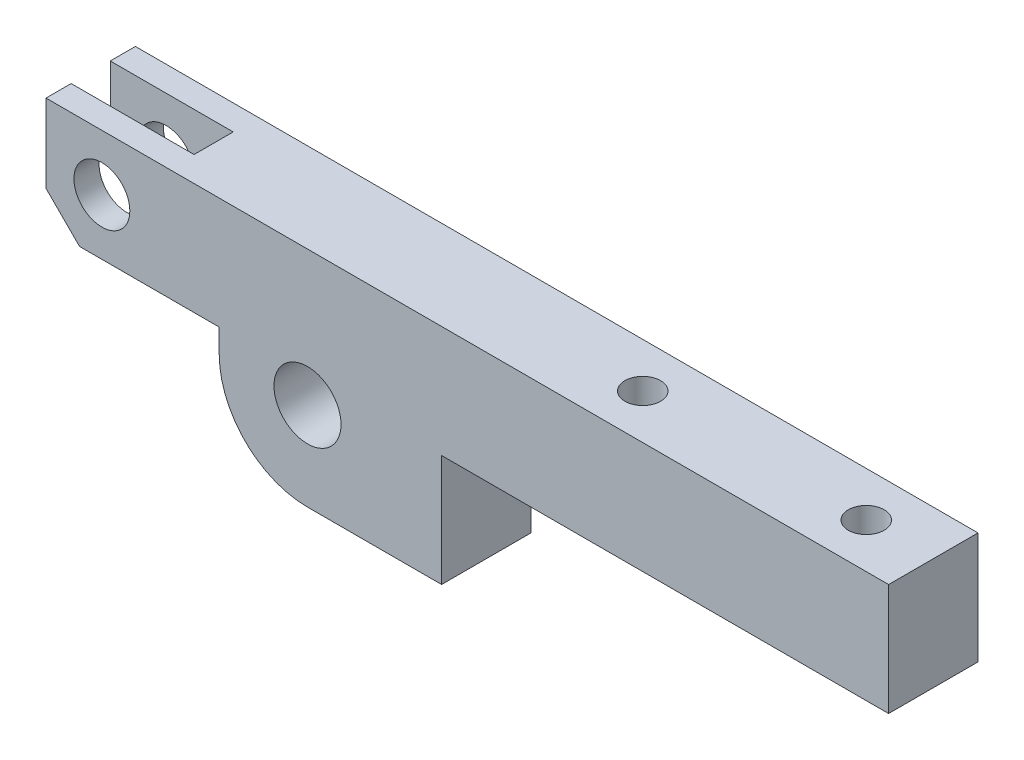
ISO-10303-21;
HEADER;
FILE_DESCRIPTION(('STEP AP214'),'2;1');
FILE_NAME('part.step','',(''),(''),'','','');
FILE_SCHEMA(('AUTOMOTIVE_DESIGN { 1 0 10303 214 1 1 1 1 }'));
ENDSEC;
DATA;
#1=APPLICATION_CONTEXT('core data for automotive mechanical design processes');
#2=APPLICATION_PROTOCOL_DEFINITION('international standard','automotive_design',2000,#1);
#3=PRODUCT_CONTEXT('',#1,'mechanical');
#4=PRODUCT('Part','Part','',(#3));
#5=PRODUCT_RELATED_PRODUCT_CATEGORY('part','',(#4));
#6=PRODUCT_DEFINITION_FORMATION('','',#4);
#7=PRODUCT_DEFINITION_CONTEXT('part definition',#1,'design');
#8=PRODUCT_DEFINITION('design','',#6,#7);
#9=PRODUCT_DEFINITION_SHAPE('','',#8);
#10=(LENGTH_UNIT() NAMED_UNIT(*) SI_UNIT(.MILLI.,.METRE.));
#11=(NAMED_UNIT(*) PLANE_ANGLE_UNIT() SI_UNIT($,.RADIAN.));
#12=(NAMED_UNIT(*) SI_UNIT($,.STERADIAN.) SOLID_ANGLE_UNIT());
#13=UNCERTAINTY_MEASURE_WITH_UNIT(LENGTH_MEASURE(1.E-05),#10,'distance_accuracy_value','');
#14=(GEOMETRIC_REPRESENTATION_CONTEXT(3) GLOBAL_UNCERTAINTY_ASSIGNED_CONTEXT((#13)) GLOBAL_UNIT_ASSIGNED_CONTEXT((#10,
#11,#12)) REPRESENTATION_CONTEXT('',''));
#15=CARTESIAN_POINT('',(0.,0.,0.));
#16=DIRECTION('',(0.,0.,1.));
#17=DIRECTION('',(1.,0.,0.));
#18=AXIS2_PLACEMENT_3D('',#15,#16,#17);
#19=CARTESIAN_POINT('',(-23.4,2.1,4.));
#20=DIRECTION('',(1.,0.,0.));
#21=DIRECTION('',(0.,0.,-1.));
#22=AXIS2_PLACEMENT_3D('',#19,#20,#21);
#23=PLANE('',#22);
#24=DIRECTION('',(0.,-1.,0.));
#25=VECTOR('',#24,1.);
#26=CARTESIAN_POINT('',(-23.4,12.1,-1.75));
#27=LINE('',#26,#25);
#28=CARTESIAN_POINT('',(-23.4,12.1,-1.75));
#29=VERTEX_POINT('',#28);
#30=CARTESIAN_POINT('',(-23.4,5.10000000000001,-1.75));
#31=VERTEX_POINT('',#30);
#32=EDGE_CURVE('E148',#29,#31,#27,.T.);
#33=ORIENTED_EDGE('',*,*,#32,.F.);
#34=DIRECTION('',(0.,0.,-1.));
#35=VECTOR('',#34,1.);
#36=CARTESIAN_POINT('',(-23.4,12.1,4.));
#37=LINE('',#36,#35);
#38=CARTESIAN_POINT('',(-23.4,12.1,-4.));
#39=VERTEX_POINT('',#38);
#40=EDGE_CURVE('E160',#29,#39,#37,.T.);
#41=ORIENTED_EDGE('',*,*,#40,.T.);
#42=DIRECTION('',(0.,-1.,0.));
#43=VECTOR('',#42,1.);
#44=CARTESIAN_POINT('',(-23.4,2.1,-4.));
#45=LINE('',#44,#43);
#46=CARTESIAN_POINT('',(-23.4,5.10000000000001,-4.));
#47=VERTEX_POINT('',#46);
#48=EDGE_CURVE('E252',#39,#47,#45,.T.);
#49=ORIENTED_EDGE('',*,*,#48,.T.);
#50=DIRECTION('',(0.,0.,1.));
#51=VECTOR('',#50,1.);
#52=CARTESIAN_POINT('',(-23.4,5.10000000000001,4.));
#53=LINE('',#52,#51);
#54=EDGE_CURVE('E43',#47,#31,#53,.T.);
#55=ORIENTED_EDGE('',*,*,#54,.T.);
#56=EDGE_LOOP('',(#33,#41,#49,#55));
#57=FACE_BOUND('',#56,.T.);
#58=ADVANCED_FACE('F34',(#57),#23,.F.);
#59=CARTESIAN_POINT('',(-7.9,2.1,4.));
#60=DIRECTION('',(0.,1.,0.));
#61=DIRECTION('',(-1.,0.,0.));
#62=AXIS2_PLACEMENT_3D('',#59,#60,#61);
#63=PLANE('',#62);
#64=DIRECTION('',(1.,0.,0.));
#65=VECTOR('',#64,1.);
#66=CARTESIAN_POINT('',(-20.4,2.1,-1.75));
#67=LINE('',#66,#65);
#68=CARTESIAN_POINT('',(-20.4,2.1,-1.75));
#69=VERTEX_POINT('',#68);
#70=CARTESIAN_POINT('',(-12.4,2.1,-1.75));
#71=VERTEX_POINT('',#70);
#72=EDGE_CURVE('E223',#69,#71,#67,.T.);
#73=ORIENTED_EDGE('',*,*,#72,.F.);
#74=DIRECTION('',(0.,0.,-1.));
#75=VECTOR('',#74,1.);
#76=CARTESIAN_POINT('',(-20.4,2.1,4.));
#77=LINE('',#76,#75);
#78=CARTESIAN_POINT('',(-20.4,2.1,-4.));
#79=VERTEX_POINT('',#78);
#80=EDGE_CURVE('E199',#69,#79,#77,.T.);
#81=ORIENTED_EDGE('',*,*,#80,.T.);
#82=DIRECTION('',(1.,0.,0.));
#83=VECTOR('',#82,1.);
#84=CARTESIAN_POINT('',(-7.9,2.1,-4.));
#85=LINE('',#84,#83);
#86=CARTESIAN_POINT('',(-7.9,2.1,-4.));
#87=VERTEX_POINT('',#86);
#88=EDGE_CURVE('E271',#79,#87,#85,.T.);
#89=ORIENTED_EDGE('',*,*,#88,.T.);
#90=DIRECTION('',(0.,0.,-1.));
#91=VECTOR('',#90,1.);
#92=CARTESIAN_POINT('',(-7.9,2.1,4.));
#93=LINE('',#92,#91);
#94=CARTESIAN_POINT('',(-7.9,2.1,4.));
#95=VERTEX_POINT('',#94);
#96=EDGE_CURVE('E196',#95,#87,#93,.T.);
#97=ORIENTED_EDGE('',*,*,#96,.F.);
#98=DIRECTION('',(1.,0.,0.));
#99=VECTOR('',#98,1.);
#100=CARTESIAN_POINT('',(-7.9,2.1,4.));
#101=LINE('',#100,#99);
#102=CARTESIAN_POINT('',(-20.4,2.1,4.));
#103=VERTEX_POINT('',#102);
#104=EDGE_CURVE('E257',#103,#95,#101,.T.);
#105=ORIENTED_EDGE('',*,*,#104,.F.);
#106=CARTESIAN_POINT('',(-20.4,2.1,1.75));
#107=VERTEX_POINT('',#106);
#108=EDGE_CURVE('E200',#103,#107,#77,.T.);
#109=ORIENTED_EDGE('',*,*,#108,.T.);
#110=DIRECTION('',(1.,0.,0.));
#111=VECTOR('',#110,1.);
#112=CARTESIAN_POINT('',(-20.4,2.1,1.75));
#113=LINE('',#112,#111);
#114=CARTESIAN_POINT('',(-12.4,2.1,1.75));
#115=VERTEX_POINT('',#114);
#116=EDGE_CURVE('E51',#107,#115,#113,.T.);
#117=ORIENTED_EDGE('',*,*,#116,.T.);
#118=DIRECTION('',(0.,0.,1.));
#119=VECTOR('',#118,1.);
#120=CARTESIAN_POINT('',(-12.4,2.1,-1.75));
#121=LINE('',#120,#119);
#122=EDGE_CURVE('E225',#71,#115,#121,.T.);
#123=ORIENTED_EDGE('',*,*,#122,.F.);
#124=EDGE_LOOP('',(#73,#81,#89,#97,#105,#109,#117,#123));
#125=FACE_BOUND('',#124,.T.);
#126=ADVANCED_FACE('F303',(#125),#63,.F.);
#127=CARTESIAN_POINT('',(-23.4,12.1,4.));
#128=DIRECTION('',(0.,-1.,0.));
#129=DIRECTION('',(0.,0.,-1.));
#130=AXIS2_PLACEMENT_3D('',#127,#128,#129);
#131=PLANE('',#130);
#132=CARTESIAN_POINT('',(26.,12.1,0.));
#133=DIRECTION('',(0.,1.,0.));
#134=DIRECTION('',(0.,0.,1.));
#135=AXIS2_PLACEMENT_3D('',#132,#133,#134);
#136=CIRCLE('',#135,1.6);
#137=CARTESIAN_POINT('',(26.,12.1,1.6));
#138=VERTEX_POINT('',#137);
#139=EDGE_CURVE('E219',#138,#138,#136,.T.);
#140=ORIENTED_EDGE('',*,*,#139,.F.);
#141=EDGE_LOOP('',(#140));
#142=FACE_BOUND('',#141,.T.);
#143=CARTESIAN_POINT('',(46.,12.1,0.));
#144=DIRECTION('',(0.,1.,0.));
#145=DIRECTION('',(0.,0.,1.));
#146=AXIS2_PLACEMENT_3D('',#143,#144,#145);
#147=CIRCLE('',#146,1.6);
#148=CARTESIAN_POINT('',(46.,12.1,1.6));
#149=VERTEX_POINT('',#148);
#150=EDGE_CURVE('E208',#149,#149,#147,.T.);
#151=ORIENTED_EDGE('',*,*,#150,.F.);
#152=EDGE_LOOP('',(#151));
#153=FACE_BOUND('',#152,.T.);
#154=DIRECTION('',(-1.,0.,0.));
#155=VECTOR('',#154,1.);
#156=CARTESIAN_POINT('',(-12.4,12.1,-1.75));
#157=LINE('',#156,#155);
#158=CARTESIAN_POINT('',(-12.4,12.1,-1.75));
#159=VERTEX_POINT('',#158);
#160=EDGE_CURVE('E145',#159,#29,#157,.T.);
#161=ORIENTED_EDGE('',*,*,#160,.F.);
#162=DIRECTION('',(0.,0.,1.));
#163=VECTOR('',#162,1.);
#164=CARTESIAN_POINT('',(-12.4,12.1,-1.75));
#165=LINE('',#164,#163);
#166=CARTESIAN_POINT('',(-12.4,12.1,1.75));
#167=VERTEX_POINT('',#166);
#168=EDGE_CURVE('E233',#159,#167,#165,.T.);
#169=ORIENTED_EDGE('',*,*,#168,.T.);
#170=DIRECTION('',(-1.,0.,0.));
#171=VECTOR('',#170,1.);
#172=CARTESIAN_POINT('',(-12.4,12.1,1.75));
#173=LINE('',#172,#171);
#174=CARTESIAN_POINT('',(-23.4,12.1,1.75));
#175=VERTEX_POINT('',#174);
#176=EDGE_CURVE('E207',#167,#175,#173,.T.);
#177=ORIENTED_EDGE('',*,*,#176,.T.);
#178=CARTESIAN_POINT('',(-23.4,12.1,4.));
#179=VERTEX_POINT('',#178);
#180=EDGE_CURVE('E170',#179,#175,#37,.T.);
#181=ORIENTED_EDGE('',*,*,#180,.F.);
#182=DIRECTION('',(-1.,0.,0.));
#183=VECTOR('',#182,1.);
#184=CARTESIAN_POINT('',(-23.4,12.1,4.));
#185=LINE('',#184,#183);
#186=CARTESIAN_POINT('',(52.,12.1,4.));
#187=VERTEX_POINT('',#186);
#188=EDGE_CURVE('E171',#187,#179,#185,.T.);
#189=ORIENTED_EDGE('',*,*,#188,.F.);
#190=DIRECTION('',(0.,0.,-1.));
#191=VECTOR('',#190,1.);
#192=CARTESIAN_POINT('',(52.,12.1,4.));
#193=LINE('',#192,#191);
#194=CARTESIAN_POINT('',(52.,12.1,-4.));
#195=VERTEX_POINT('',#194);
#196=EDGE_CURVE('E174',#187,#195,#193,.T.);
#197=ORIENTED_EDGE('',*,*,#196,.T.);
#198=DIRECTION('',(-1.,0.,0.));
#199=VECTOR('',#198,1.);
#200=CARTESIAN_POINT('',(-23.4,12.1,-4.));
#201=LINE('',#200,#199);
#202=EDGE_CURVE('E168',#195,#39,#201,.T.);
#203=ORIENTED_EDGE('',*,*,#202,.T.);
#204=ORIENTED_EDGE('',*,*,#40,.F.);
#205=EDGE_LOOP('',(#161,#169,#177,#181,#189,#197,#203,#204));
#206=FACE_BOUND('',#205,.T.);
#207=ADVANCED_FACE('F165',(#142,#153,#206),#131,.F.);
#208=CARTESIAN_POINT('',(-18.4,7.1,4.));
#209=DIRECTION('',(0.,0.,-1.));
#210=DIRECTION('',(-1.,0.,0.));
#211=AXIS2_PLACEMENT_3D('',#208,#209,#210);
#212=CYLINDRICAL_SURFACE('',#211,2.5);
#213=CARTESIAN_POINT('',(-18.4,7.1,-4.));
#214=DIRECTION('',(0.,0.,1.));
#215=DIRECTION('',(1.,0.,0.));
#216=AXIS2_PLACEMENT_3D('',#213,#214,#215);
#217=CIRCLE('',#216,2.5);
#218=CARTESIAN_POINT('',(-15.9,7.1,-4.));
#219=VERTEX_POINT('',#218);
#220=EDGE_CURVE('E242',#219,#219,#217,.T.);
#221=ORIENTED_EDGE('',*,*,#220,.F.);
#222=EDGE_LOOP('',(#221));
#223=FACE_BOUND('',#222,.T.);
#224=CARTESIAN_POINT('',(-18.4,7.1,-1.75));
#225=DIRECTION('',(0.,0.,1.));
#226=DIRECTION('',(1.,0.,0.));
#227=AXIS2_PLACEMENT_3D('',#224,#225,#226);
#228=CIRCLE('',#227,2.5);
#229=CARTESIAN_POINT('',(-15.9,7.1,-1.75));
#230=VERTEX_POINT('',#229);
#231=EDGE_CURVE('E239',#230,#230,#228,.T.);
#232=ORIENTED_EDGE('',*,*,#231,.T.);
#233=EDGE_LOOP('',(#232));
#234=FACE_BOUND('',#233,.T.);
#235=ADVANCED_FACE('F370',(#223,#234),#212,.F.);
#236=CARTESIAN_POINT('',(-20.4,2.1,4.));
#237=DIRECTION('',(0.707106781186549,0.707106781186546,0.));
#238=DIRECTION('',(-0.707106781186546,0.707106781186549,0.));
#239=AXIS2_PLACEMENT_3D('',#236,#237,#238);
#240=PLANE('',#239);
#241=ORIENTED_EDGE('',*,*,#80,.F.);
#242=DIRECTION('',(0.707106781186547,-0.707106781186548,0.));
#243=VECTOR('',#242,1.);
#244=CARTESIAN_POINT('',(-23.4,5.10000000000001,-1.75));
#245=LINE('',#244,#243);
#246=EDGE_CURVE('E163',#31,#69,#245,.T.);
#247=ORIENTED_EDGE('',*,*,#246,.F.);
#248=ORIENTED_EDGE('',*,*,#54,.F.);
#249=DIRECTION('',(0.707106781186546,-0.707106781186549,0.));
#250=VECTOR('',#249,1.);
#251=CARTESIAN_POINT('',(-9.15000000000003,-9.15000000000001,-4.));
#252=LINE('',#251,#250);
#253=EDGE_CURVE('E203',#79,#47,#252,.F.);
#254=ORIENTED_EDGE('',*,*,#253,.F.);
#255=EDGE_LOOP('',(#241,#247,#248,#254));
#256=FACE_BOUND('',#255,.T.);
#257=ADVANCED_FACE('F299',(#256),#240,.F.);
#258=CARTESIAN_POINT('',(0.,0.,4.));
#259=DIRECTION('',(0.,0.,-1.));
#260=DIRECTION('',(-1.,0.,0.));
#261=AXIS2_PLACEMENT_3D('',#258,#259,#260);
#262=PLANE('',#261);
#263=CARTESIAN_POINT('',(0.,0.,4.));
#264=DIRECTION('',(0.,0.,1.));
#265=DIRECTION('',(1.,0.,0.));
#266=AXIS2_PLACEMENT_3D('',#263,#264,#265);
#267=CIRCLE('',#266,3.);
#268=CARTESIAN_POINT('',(3.,0.,4.));
#269=VERTEX_POINT('',#268);
#270=EDGE_CURVE('E249',#269,#269,#267,.T.);
#271=ORIENTED_EDGE('',*,*,#270,.F.);
#272=EDGE_LOOP('',(#271));
#273=FACE_BOUND('',#272,.T.);
#274=DIRECTION('',(0.,-1.,0.));
#275=VECTOR('',#274,1.);
#276=CARTESIAN_POINT('',(-23.4,2.1,4.));
#277=LINE('',#276,#275);
#278=CARTESIAN_POINT('',(-23.4,5.10000000000001,4.));
#279=VERTEX_POINT('',#278);
#280=EDGE_CURVE('E255',#179,#279,#277,.T.);
#281=ORIENTED_EDGE('',*,*,#280,.T.);
#282=DIRECTION('',(-0.707106781186546,0.707106781186549,0.));
#283=VECTOR('',#282,1.);
#284=CARTESIAN_POINT('',(-20.4,2.1,4.));
#285=LINE('',#284,#283);
#286=EDGE_CURVE('E11',#279,#103,#285,.F.);
#287=ORIENTED_EDGE('',*,*,#286,.T.);
#288=ORIENTED_EDGE('',*,*,#104,.T.);
#289=DIRECTION('',(0.,-1.,0.));
#290=VECTOR('',#289,1.);
#291=CARTESIAN_POINT('',(-7.9,0.,4.));
#292=LINE('',#291,#290);
#293=CARTESIAN_POINT('',(-7.9,0.,4.));
#294=VERTEX_POINT('',#293);
#295=EDGE_CURVE('E259',#95,#294,#292,.T.);
#296=ORIENTED_EDGE('',*,*,#295,.T.);
#297=CARTESIAN_POINT('',(0.,0.,4.));
#298=DIRECTION('',(0.,0.,1.));
#299=DIRECTION('',(-1.,0.,0.));
#300=AXIS2_PLACEMENT_3D('',#297,#298,#299);
#301=CIRCLE('',#300,7.9);
#302=CARTESIAN_POINT('',(0.,-7.9,4.));
#303=VERTEX_POINT('',#302);
#304=EDGE_CURVE('E261',#294,#303,#301,.T.);
#305=ORIENTED_EDGE('',*,*,#304,.T.);
#306=DIRECTION('',(1.,0.,0.));
#307=VECTOR('',#306,1.);
#308=CARTESIAN_POINT('',(12.,-7.9,4.));
#309=LINE('',#308,#307);
#310=CARTESIAN_POINT('',(12.,-7.9,4.));
#311=VERTEX_POINT('',#310);
#312=EDGE_CURVE('E263',#303,#311,#309,.T.);
#313=ORIENTED_EDGE('',*,*,#312,.T.);
#314=DIRECTION('',(0.,1.,0.));
#315=VECTOR('',#314,1.);
#316=CARTESIAN_POINT('',(12.,2.09999999999999,4.));
#317=LINE('',#316,#315);
#318=CARTESIAN_POINT('',(12.,2.09999999999999,4.));
#319=VERTEX_POINT('',#318);
#320=EDGE_CURVE('E265',#311,#319,#317,.T.);
#321=ORIENTED_EDGE('',*,*,#320,.T.);
#322=DIRECTION('',(1.,0.,0.));
#323=VECTOR('',#322,1.);
#324=CARTESIAN_POINT('',(52.,2.1,4.));
#325=LINE('',#324,#323);
#326=CARTESIAN_POINT('',(52.,2.1,4.));
#327=VERTEX_POINT('',#326);
#328=EDGE_CURVE('E267',#319,#327,#325,.T.);
#329=ORIENTED_EDGE('',*,*,#328,.T.);
#330=DIRECTION('',(0.,1.,0.));
#331=VECTOR('',#330,1.);
#332=CARTESIAN_POINT('',(52.,12.1,4.));
#333=LINE('',#332,#331);
#334=EDGE_CURVE('E175',#327,#187,#333,.T.);
#335=ORIENTED_EDGE('',*,*,#334,.T.);
#336=ORIENTED_EDGE('',*,*,#188,.T.);
#337=EDGE_LOOP('',(#281,#287,#288,#296,#305,#313,#321,#329,#335,#336));
#338=FACE_BOUND('',#337,.T.);
#339=CARTESIAN_POINT('',(-18.4,7.1,4.));
#340=DIRECTION('',(0.,0.,1.));
#341=DIRECTION('',(1.,0.,0.));
#342=AXIS2_PLACEMENT_3D('',#339,#340,#341);
#343=CIRCLE('',#342,2.5);
#344=CARTESIAN_POINT('',(-15.9,7.1,4.));
#345=VERTEX_POINT('',#344);
#346=EDGE_CURVE('E243',#345,#345,#343,.T.);
#347=ORIENTED_EDGE('',*,*,#346,.F.);
#348=EDGE_LOOP('',(#347));
#349=FACE_BOUND('',#348,.T.);
#350=ADVANCED_FACE('F310',(#273,#338,#349),#262,.F.);
#351=CARTESIAN_POINT('',(0.,0.,-4.));
#352=DIRECTION('',(0.,0.,-1.));
#353=DIRECTION('',(-1.,0.,0.));
#354=AXIS2_PLACEMENT_3D('',#351,#352,#353);
#355=PLANE('',#354);
#356=CARTESIAN_POINT('',(0.,0.,-4.));
#357=DIRECTION('',(0.,0.,1.));
#358=DIRECTION('',(1.,0.,0.));
#359=AXIS2_PLACEMENT_3D('',#356,#357,#358);
#360=CIRCLE('',#359,3.);
#361=CARTESIAN_POINT('',(3.,0.,-4.));
#362=VERTEX_POINT('',#361);
#363=EDGE_CURVE('E246',#362,#362,#360,.T.);
#364=ORIENTED_EDGE('',*,*,#363,.T.);
#365=EDGE_LOOP('',(#364));
#366=FACE_BOUND('',#365,.T.);
#367=ORIENTED_EDGE('',*,*,#88,.F.);
#368=ORIENTED_EDGE('',*,*,#253,.T.);
#369=ORIENTED_EDGE('',*,*,#48,.F.);
#370=ORIENTED_EDGE('',*,*,#202,.F.);
#371=DIRECTION('',(0.,1.,0.));
#372=VECTOR('',#371,1.);
#373=CARTESIAN_POINT('',(52.,12.1,-4.));
#374=LINE('',#373,#372);
#375=CARTESIAN_POINT('',(52.,2.1,-4.));
#376=VERTEX_POINT('',#375);
#377=EDGE_CURVE('E282',#376,#195,#374,.T.);
#378=ORIENTED_EDGE('',*,*,#377,.F.);
#379=DIRECTION('',(1.,0.,0.));
#380=VECTOR('',#379,1.);
#381=CARTESIAN_POINT('',(52.,2.1,-4.));
#382=LINE('',#381,#380);
#383=CARTESIAN_POINT('',(12.,2.09999999999999,-4.));
#384=VERTEX_POINT('',#383);
#385=EDGE_CURVE('E281',#384,#376,#382,.T.);
#386=ORIENTED_EDGE('',*,*,#385,.F.);
#387=DIRECTION('',(0.,1.,0.));
#388=VECTOR('',#387,1.);
#389=CARTESIAN_POINT('',(12.,2.09999999999999,-4.));
#390=LINE('',#389,#388);
#391=CARTESIAN_POINT('',(12.,-7.9,-4.));
#392=VERTEX_POINT('',#391);
#393=EDGE_CURVE('E279',#392,#384,#390,.T.);
#394=ORIENTED_EDGE('',*,*,#393,.F.);
#395=DIRECTION('',(1.,0.,0.));
#396=VECTOR('',#395,1.);
#397=CARTESIAN_POINT('',(12.,-7.9,-4.));
#398=LINE('',#397,#396);
#399=CARTESIAN_POINT('',(0.,-7.9,-4.));
#400=VERTEX_POINT('',#399);
#401=EDGE_CURVE('E277',#400,#392,#398,.T.);
#402=ORIENTED_EDGE('',*,*,#401,.F.);
#403=CARTESIAN_POINT('',(0.,0.,-4.));
#404=DIRECTION('',(0.,0.,1.));
#405=DIRECTION('',(-1.,0.,0.));
#406=AXIS2_PLACEMENT_3D('',#403,#404,#405);
#407=CIRCLE('',#406,7.9);
#408=CARTESIAN_POINT('',(-7.9,0.,-4.));
#409=VERTEX_POINT('',#408);
#410=EDGE_CURVE('E275',#409,#400,#407,.T.);
#411=ORIENTED_EDGE('',*,*,#410,.F.);
#412=DIRECTION('',(0.,-1.,0.));
#413=VECTOR('',#412,1.);
#414=CARTESIAN_POINT('',(-7.9,0.,-4.));
#415=LINE('',#414,#413);
#416=EDGE_CURVE('E273',#87,#409,#415,.T.);
#417=ORIENTED_EDGE('',*,*,#416,.F.);
#418=EDGE_LOOP('',(#367,#368,#369,#370,#378,#386,#394,#402,#411,#417));
#419=FACE_BOUND('',#418,.T.);
#420=ORIENTED_EDGE('',*,*,#220,.T.);
#421=EDGE_LOOP('',(#420));
#422=FACE_BOUND('',#421,.T.);
#423=ADVANCED_FACE('F294',(#366,#419,#422),#355,.T.);
#424=ORIENTED_EDGE('',*,*,#180,.T.);
#425=DIRECTION('',(0.,-1.,0.));
#426=VECTOR('',#425,1.);
#427=CARTESIAN_POINT('',(-23.4,12.1,1.75));
#428=LINE('',#427,#426);
#429=CARTESIAN_POINT('',(-23.4,5.10000000000001,1.75));
#430=VERTEX_POINT('',#429);
#431=EDGE_CURVE('E212',#175,#430,#428,.T.);
#432=ORIENTED_EDGE('',*,*,#431,.T.);
#433=EDGE_CURVE('E59',#430,#279,#53,.T.);
#434=ORIENTED_EDGE('',*,*,#433,.T.);
#435=ORIENTED_EDGE('',*,*,#280,.F.);
#436=EDGE_LOOP('',(#424,#432,#434,#435));
#437=FACE_BOUND('',#436,.T.);
#438=ADVANCED_FACE('F307',(#437),#23,.F.);
#439=CARTESIAN_POINT('',(-7.9,0.,4.));
#440=DIRECTION('',(1.,0.,0.));
#441=DIRECTION('',(0.,1.,0.));
#442=AXIS2_PLACEMENT_3D('',#439,#440,#441);
#443=PLANE('',#442);
#444=ORIENTED_EDGE('',*,*,#416,.T.);
#445=DIRECTION('',(0.,0.,-1.));
#446=VECTOR('',#445,1.);
#447=CARTESIAN_POINT('',(-7.9,0.,4.));
#448=LINE('',#447,#446);
#449=EDGE_CURVE('E193',#294,#409,#448,.T.);
#450=ORIENTED_EDGE('',*,*,#449,.F.);
#451=ORIENTED_EDGE('',*,*,#295,.F.);
#452=ORIENTED_EDGE('',*,*,#96,.T.);
#453=EDGE_LOOP('',(#444,#450,#451,#452));
#454=FACE_BOUND('',#453,.T.);
#455=ADVANCED_FACE('F321',(#454),#443,.F.);
#456=CARTESIAN_POINT('',(0.,0.,4.));
#457=DIRECTION('',(0.,0.,-1.));
#458=DIRECTION('',(-1.,0.,0.));
#459=AXIS2_PLACEMENT_3D('',#456,#457,#458);
#460=CYLINDRICAL_SURFACE('',#459,7.9);
#461=ORIENTED_EDGE('',*,*,#410,.T.);
#462=DIRECTION('',(0.,0.,-1.));
#463=VECTOR('',#462,1.);
#464=CARTESIAN_POINT('',(0.,-7.9,4.));
#465=LINE('',#464,#463);
#466=EDGE_CURVE('E190',#303,#400,#465,.T.);
#467=ORIENTED_EDGE('',*,*,#466,.F.);
#468=ORIENTED_EDGE('',*,*,#304,.F.);
#469=ORIENTED_EDGE('',*,*,#449,.T.);
#470=EDGE_LOOP('',(#461,#467,#468,#469));
#471=FACE_BOUND('',#470,.T.);
#472=ADVANCED_FACE('F325',(#471),#460,.T.);
#473=CARTESIAN_POINT('',(12.,-7.9,4.));
#474=DIRECTION('',(0.,1.,0.));
#475=DIRECTION('',(-1.,0.,0.));
#476=AXIS2_PLACEMENT_3D('',#473,#474,#475);
#477=PLANE('',#476);
#478=ORIENTED_EDGE('',*,*,#401,.T.);
#479=DIRECTION('',(0.,0.,-1.));
#480=VECTOR('',#479,1.);
#481=CARTESIAN_POINT('',(12.,-7.9,4.));
#482=LINE('',#481,#480);
#483=EDGE_CURVE('E187',#311,#392,#482,.T.);
#484=ORIENTED_EDGE('',*,*,#483,.F.);
#485=ORIENTED_EDGE('',*,*,#312,.F.);
#486=ORIENTED_EDGE('',*,*,#466,.T.);
#487=EDGE_LOOP('',(#478,#484,#485,#486));
#488=FACE_BOUND('',#487,.T.);
#489=ADVANCED_FACE('F330',(#488),#477,.F.);
#490=CARTESIAN_POINT('',(12.,2.09999999999999,4.));
#491=DIRECTION('',(-1.,0.,0.));
#492=DIRECTION('',(0.,0.,1.));
#493=AXIS2_PLACEMENT_3D('',#490,#491,#492);
#494=PLANE('',#493);
#495=ORIENTED_EDGE('',*,*,#393,.T.);
#496=DIRECTION('',(0.,0.,-1.));
#497=VECTOR('',#496,1.);
#498=CARTESIAN_POINT('',(12.,2.09999999999999,4.));
#499=LINE('',#498,#497);
#500=EDGE_CURVE('E184',#319,#384,#499,.T.);
#501=ORIENTED_EDGE('',*,*,#500,.F.);
#502=ORIENTED_EDGE('',*,*,#320,.F.);
#503=ORIENTED_EDGE('',*,*,#483,.T.);
#504=EDGE_LOOP('',(#495,#501,#502,#503));
#505=FACE_BOUND('',#504,.T.);
#506=ADVANCED_FACE('F335',(#505),#494,.F.);
#507=CARTESIAN_POINT('',(52.,2.1,4.));
#508=DIRECTION('',(0.,1.,0.));
#509=DIRECTION('',(-1.,0.,0.));
#510=AXIS2_PLACEMENT_3D('',#507,#508,#509);
#511=PLANE('',#510);
#512=CARTESIAN_POINT('',(26.,2.1,0.));
#513=DIRECTION('',(0.,1.,0.));
#514=DIRECTION('',(-1.,0.,0.));
#515=AXIS2_PLACEMENT_3D('',#512,#513,#514);
#516=CIRCLE('',#515,1.6);
#517=CARTESIAN_POINT('',(24.4,2.1,0.));
#518=VERTEX_POINT('',#517);
#519=EDGE_CURVE('E38',#518,#518,#516,.T.);
#520=ORIENTED_EDGE('',*,*,#519,.T.);
#521=EDGE_LOOP('',(#520));
#522=FACE_BOUND('',#521,.T.);
#523=CARTESIAN_POINT('',(46.,2.1,0.));
#524=DIRECTION('',(0.,1.,0.));
#525=DIRECTION('',(-1.,0.,0.));
#526=AXIS2_PLACEMENT_3D('',#523,#524,#525);
#527=CIRCLE('',#526,1.6);
#528=CARTESIAN_POINT('',(44.4,2.1,0.));
#529=VERTEX_POINT('',#528);
#530=EDGE_CURVE('E205',#529,#529,#527,.T.);
#531=ORIENTED_EDGE('',*,*,#530,.T.);
#532=EDGE_LOOP('',(#531));
#533=FACE_BOUND('',#532,.T.);
#534=ORIENTED_EDGE('',*,*,#385,.T.);
#535=DIRECTION('',(0.,0.,-1.));
#536=VECTOR('',#535,1.);
#537=CARTESIAN_POINT('',(52.,2.1,4.));
#538=LINE('',#537,#536);
#539=EDGE_CURVE('E181',#327,#376,#538,.T.);
#540=ORIENTED_EDGE('',*,*,#539,.F.);
#541=ORIENTED_EDGE('',*,*,#328,.F.);
#542=ORIENTED_EDGE('',*,*,#500,.T.);
#543=EDGE_LOOP('',(#534,#540,#541,#542));
#544=FACE_BOUND('',#543,.T.);
#545=ADVANCED_FACE('F338',(#522,#533,#544),#511,.F.);
#546=CARTESIAN_POINT('',(52.,12.1,4.));
#547=DIRECTION('',(-1.,0.,0.));
#548=DIRECTION('',(0.,0.,1.));
#549=AXIS2_PLACEMENT_3D('',#546,#547,#548);
#550=PLANE('',#549);
#551=ORIENTED_EDGE('',*,*,#377,.T.);
#552=ORIENTED_EDGE('',*,*,#196,.F.);
#553=ORIENTED_EDGE('',*,*,#334,.F.);
#554=ORIENTED_EDGE('',*,*,#539,.T.);
#555=EDGE_LOOP('',(#551,#552,#553,#554));
#556=FACE_BOUND('',#555,.T.);
#557=ADVANCED_FACE('F286',(#556),#550,.F.);
#558=CARTESIAN_POINT('',(0.,0.,4.));
#559=DIRECTION('',(0.,0.,-1.));
#560=DIRECTION('',(-1.,0.,0.));
#561=AXIS2_PLACEMENT_3D('',#558,#559,#560);
#562=CYLINDRICAL_SURFACE('',#561,3.);
#563=ORIENTED_EDGE('',*,*,#270,.T.);
#564=EDGE_LOOP('',(#563));
#565=FACE_BOUND('',#564,.T.);
#566=ORIENTED_EDGE('',*,*,#363,.F.);
#567=EDGE_LOOP('',(#566));
#568=FACE_BOUND('',#567,.T.);
#569=ADVANCED_FACE('F346',(#565,#568),#562,.F.);
#570=CARTESIAN_POINT('',(-18.4,7.1,1.75));
#571=DIRECTION('',(0.,0.,1.));
#572=DIRECTION('',(1.,0.,0.));
#573=AXIS2_PLACEMENT_3D('',#570,#571,#572);
#574=CIRCLE('',#573,2.5);
#575=CARTESIAN_POINT('',(-15.9,7.1,1.75));
#576=VERTEX_POINT('',#575);
#577=EDGE_CURVE('E235',#576,#576,#574,.T.);
#578=ORIENTED_EDGE('',*,*,#577,.F.);
#579=EDGE_LOOP('',(#578));
#580=FACE_BOUND('',#579,.T.);
#581=ORIENTED_EDGE('',*,*,#346,.T.);
#582=EDGE_LOOP('',(#581));
#583=FACE_BOUND('',#582,.T.);
#584=ADVANCED_FACE('F377',(#580,#583),#212,.F.);
#585=DIRECTION('',(0.707106781186547,-0.707106781186548,0.));
#586=VECTOR('',#585,1.);
#587=CARTESIAN_POINT('',(-23.4,5.10000000000001,1.75));
#588=LINE('',#587,#586);
#589=EDGE_CURVE('E228',#430,#107,#588,.T.);
#590=ORIENTED_EDGE('',*,*,#589,.T.);
#591=ORIENTED_EDGE('',*,*,#108,.F.);
#592=ORIENTED_EDGE('',*,*,#286,.F.);
#593=ORIENTED_EDGE('',*,*,#433,.F.);
#594=EDGE_LOOP('',(#590,#591,#592,#593));
#595=FACE_BOUND('',#594,.T.);
#596=ADVANCED_FACE('F36',(#595),#240,.F.);
#597=CARTESIAN_POINT('',(-12.4,12.1,-1.75));
#598=DIRECTION('',(1.,0.,0.));
#599=DIRECTION('',(0.,1.,0.));
#600=AXIS2_PLACEMENT_3D('',#597,#598,#599);
#601=PLANE('',#600);
#602=DIRECTION('',(0.,1.,0.));
#603=VECTOR('',#602,1.);
#604=CARTESIAN_POINT('',(-12.4,12.1,1.75));
#605=LINE('',#604,#603);
#606=EDGE_CURVE('E155',#115,#167,#605,.T.);
#607=ORIENTED_EDGE('',*,*,#606,.T.);
#608=ORIENTED_EDGE('',*,*,#168,.F.);
#609=DIRECTION('',(0.,1.,0.));
#610=VECTOR('',#609,1.);
#611=CARTESIAN_POINT('',(-12.4,12.1,-1.75));
#612=LINE('',#611,#610);
#613=EDGE_CURVE('E151',#71,#159,#612,.T.);
#614=ORIENTED_EDGE('',*,*,#613,.F.);
#615=ORIENTED_EDGE('',*,*,#122,.T.);
#616=EDGE_LOOP('',(#607,#608,#614,#615));
#617=FACE_BOUND('',#616,.T.);
#618=ADVANCED_FACE('F305',(#617),#601,.F.);
#619=CARTESIAN_POINT('',(-23.4,12.1,-1.75));
#620=DIRECTION('',(0.,0.,1.));
#621=DIRECTION('',(1.,0.,0.));
#622=AXIS2_PLACEMENT_3D('',#619,#620,#621);
#623=PLANE('',#622);
#624=ORIENTED_EDGE('',*,*,#231,.F.);
#625=EDGE_LOOP('',(#624));
#626=FACE_BOUND('',#625,.T.);
#627=ORIENTED_EDGE('',*,*,#160,.T.);
#628=ORIENTED_EDGE('',*,*,#32,.T.);
#629=ORIENTED_EDGE('',*,*,#246,.T.);
#630=ORIENTED_EDGE('',*,*,#72,.T.);
#631=ORIENTED_EDGE('',*,*,#613,.T.);
#632=EDGE_LOOP('',(#627,#628,#629,#630,#631));
#633=FACE_BOUND('',#632,.T.);
#634=ADVANCED_FACE('F147',(#626,#633),#623,.T.);
#635=CARTESIAN_POINT('',(-23.4,12.1,1.75));
#636=DIRECTION('',(0.,0.,1.));
#637=DIRECTION('',(1.,0.,0.));
#638=AXIS2_PLACEMENT_3D('',#635,#636,#637);
#639=PLANE('',#638);
#640=ORIENTED_EDGE('',*,*,#577,.T.);
#641=EDGE_LOOP('',(#640));
#642=FACE_BOUND('',#641,.T.);
#643=ORIENTED_EDGE('',*,*,#176,.F.);
#644=ORIENTED_EDGE('',*,*,#606,.F.);
#645=ORIENTED_EDGE('',*,*,#116,.F.);
#646=ORIENTED_EDGE('',*,*,#589,.F.);
#647=ORIENTED_EDGE('',*,*,#431,.F.);
#648=EDGE_LOOP('',(#643,#644,#645,#646,#647));
#649=FACE_BOUND('',#648,.T.);
#650=ADVANCED_FACE('F306',(#642,#649),#639,.F.);
#651=CARTESIAN_POINT('',(46.,-7.9,0.));
#652=DIRECTION('',(0.,1.,0.));
#653=DIRECTION('',(0.,0.,1.));
#654=AXIS2_PLACEMENT_3D('',#651,#652,#653);
#655=CYLINDRICAL_SURFACE('',#654,1.6);
#656=ORIENTED_EDGE('',*,*,#150,.T.);
#657=EDGE_LOOP('',(#656));
#658=FACE_BOUND('',#657,.T.);
#659=ORIENTED_EDGE('',*,*,#530,.F.);
#660=EDGE_LOOP('',(#659));
#661=FACE_BOUND('',#660,.T.);
#662=ADVANCED_FACE('F385',(#658,#661),#655,.F.);
#663=CARTESIAN_POINT('',(26.,-7.9,0.));
#664=DIRECTION('',(0.,1.,0.));
#665=DIRECTION('',(0.,0.,1.));
#666=AXIS2_PLACEMENT_3D('',#663,#664,#665);
#667=CYLINDRICAL_SURFACE('',#666,1.6);
#668=ORIENTED_EDGE('',*,*,#139,.T.);
#669=EDGE_LOOP('',(#668));
#670=FACE_BOUND('',#669,.T.);
#671=ORIENTED_EDGE('',*,*,#519,.F.);
#672=EDGE_LOOP('',(#671));
#673=FACE_BOUND('',#672,.T.);
#674=ADVANCED_FACE('F382',(#670,#673),#667,.F.);
#675=CLOSED_SHELL('',(#58,#126,#207,#235,#257,#350,#423,#438,#455,#472,#489,#506,#545,#557,#569,
#584,#596,#618,#634,#650,#662,#674));
#676=MANIFOLD_SOLID_BREP('B2',#675);
#677=ADVANCED_BREP_SHAPE_REPRESENTATION('',(#18,#676),#14);
#678=SHAPE_DEFINITION_REPRESENTATION(#9,#677);
ENDSEC;
END-ISO-10303-21;
